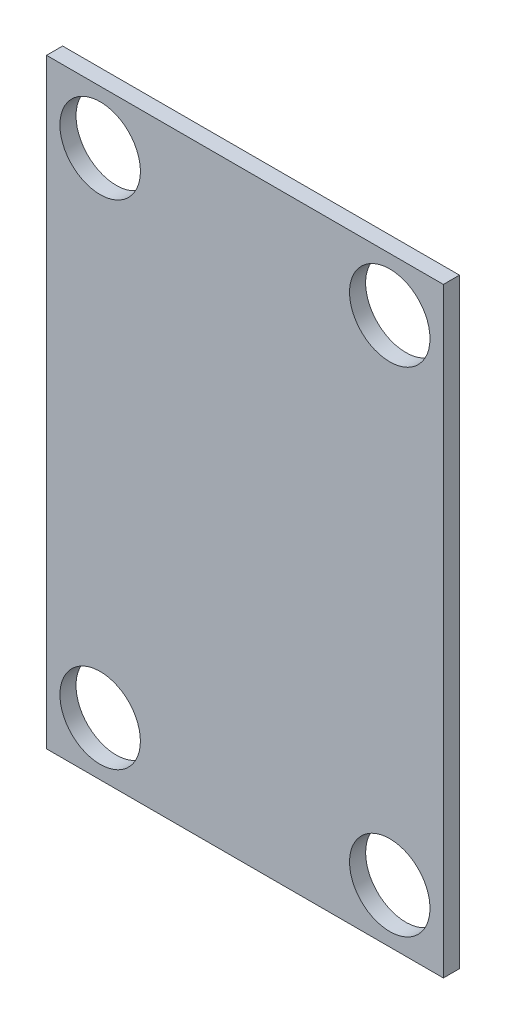
ISO-10303-21;
HEADER;
FILE_DESCRIPTION(('STEP AP214'),'2;1');
FILE_NAME('part.step','',(''),(''),'','','');
FILE_SCHEMA(('AUTOMOTIVE_DESIGN { 1 0 10303 214 1 1 1 1 }'));
ENDSEC;
DATA;
#1=APPLICATION_CONTEXT('core data for automotive mechanical design processes');
#2=APPLICATION_PROTOCOL_DEFINITION('international standard','automotive_design',2000,#1);
#3=PRODUCT_CONTEXT('',#1,'mechanical');
#4=PRODUCT('Part','Part','',(#3));
#5=PRODUCT_RELATED_PRODUCT_CATEGORY('part','',(#4));
#6=PRODUCT_DEFINITION_FORMATION('','',#4);
#7=PRODUCT_DEFINITION_CONTEXT('part definition',#1,'design');
#8=PRODUCT_DEFINITION('design','',#6,#7);
#9=PRODUCT_DEFINITION_SHAPE('','',#8);
#10=(LENGTH_UNIT() NAMED_UNIT(*) SI_UNIT(.MILLI.,.METRE.));
#11=(NAMED_UNIT(*) PLANE_ANGLE_UNIT() SI_UNIT($,.RADIAN.));
#12=(NAMED_UNIT(*) SI_UNIT($,.STERADIAN.) SOLID_ANGLE_UNIT());
#13=UNCERTAINTY_MEASURE_WITH_UNIT(LENGTH_MEASURE(1.E-05),#10,'distance_accuracy_value','');
#14=(GEOMETRIC_REPRESENTATION_CONTEXT(3) GLOBAL_UNCERTAINTY_ASSIGNED_CONTEXT((#13)) GLOBAL_UNIT_ASSIGNED_CONTEXT((#10,
#11,#12)) REPRESENTATION_CONTEXT('',''));
#15=CARTESIAN_POINT('',(0.,0.,0.));
#16=DIRECTION('',(0.,0.,1.));
#17=DIRECTION('',(1.,0.,0.));
#18=AXIS2_PLACEMENT_3D('',#15,#16,#17);
#19=CARTESIAN_POINT('',(0.,0.,1.5));
#20=DIRECTION('',(0.,0.,-1.));
#21=DIRECTION('',(-1.,0.,0.));
#22=AXIS2_PLACEMENT_3D('',#19,#20,#21);
#23=PLANE('',#22);
#24=DIRECTION('',(0.,1.,0.));
#25=VECTOR('',#24,1.);
#26=CARTESIAN_POINT('',(17.9594884742274,28.,1.5));
#27=LINE('',#26,#25);
#28=CARTESIAN_POINT('',(17.9594884742274,-28.,1.5));
#29=VERTEX_POINT('',#28);
#30=CARTESIAN_POINT('',(17.9594884742274,28.,1.5));
#31=VERTEX_POINT('',#30);
#32=EDGE_CURVE('E87',#29,#31,#27,.T.);
#33=ORIENTED_EDGE('',*,*,#32,.T.);
#34=DIRECTION('',(-1.,0.,0.));
#35=VECTOR('',#34,1.);
#36=CARTESIAN_POINT('',(17.9594884742274,28.,1.5));
#37=LINE('',#36,#35);
#38=CARTESIAN_POINT('',(-19.0405115257726,28.,1.5));
#39=VERTEX_POINT('',#38);
#40=EDGE_CURVE('E82',#31,#39,#37,.T.);
#41=ORIENTED_EDGE('',*,*,#40,.T.);
#42=DIRECTION('',(0.,-1.,0.));
#43=VECTOR('',#42,1.);
#44=CARTESIAN_POINT('',(-19.0405115257726,28.,1.5));
#45=LINE('',#44,#43);
#46=CARTESIAN_POINT('',(-19.0405115257726,-28.,1.5));
#47=VERTEX_POINT('',#46);
#48=EDGE_CURVE('E85',#39,#47,#45,.T.);
#49=ORIENTED_EDGE('',*,*,#48,.T.);
#50=DIRECTION('',(1.,0.,0.));
#51=VECTOR('',#50,1.);
#52=CARTESIAN_POINT('',(17.9594884742274,-28.,1.5));
#53=LINE('',#52,#51);
#54=EDGE_CURVE('E52',#47,#29,#53,.T.);
#55=ORIENTED_EDGE('',*,*,#54,.T.);
#56=EDGE_LOOP('',(#33,#41,#49,#55));
#57=FACE_BOUND('',#56,.T.);
#58=CARTESIAN_POINT('',(-14.0405115257726,23.,1.5));
#59=DIRECTION('',(0.,0.,1.));
#60=DIRECTION('',(-1.,0.,0.));
#61=AXIS2_PLACEMENT_3D('',#58,#59,#60);
#62=CIRCLE('',#61,3.75);
#63=CARTESIAN_POINT('',(-17.7905115257726,23.,1.5));
#64=VERTEX_POINT('',#63);
#65=EDGE_CURVE('E102',#64,#64,#62,.T.);
#66=ORIENTED_EDGE('',*,*,#65,.F.);
#67=EDGE_LOOP('',(#66));
#68=FACE_BOUND('',#67,.T.);
#69=CARTESIAN_POINT('',(-14.0405115257726,-23.,1.5));
#70=DIRECTION('',(0.,0.,1.));
#71=DIRECTION('',(1.,0.,0.));
#72=AXIS2_PLACEMENT_3D('',#69,#70,#71);
#73=CIRCLE('',#72,3.75);
#74=CARTESIAN_POINT('',(-10.2905115257726,-23.,1.5));
#75=VERTEX_POINT('',#74);
#76=EDGE_CURVE('E117',#75,#75,#73,.T.);
#77=ORIENTED_EDGE('',*,*,#76,.F.);
#78=EDGE_LOOP('',(#77));
#79=FACE_BOUND('',#78,.T.);
#80=CARTESIAN_POINT('',(12.9594884742275,23.,1.5));
#81=DIRECTION('',(0.,0.,1.));
#82=DIRECTION('',(1.,0.,0.));
#83=AXIS2_PLACEMENT_3D('',#80,#81,#82);
#84=CIRCLE('',#83,3.75);
#85=CARTESIAN_POINT('',(16.7094884742274,23.,1.5));
#86=VERTEX_POINT('',#85);
#87=EDGE_CURVE('E123',#86,#86,#84,.T.);
#88=ORIENTED_EDGE('',*,*,#87,.F.);
#89=EDGE_LOOP('',(#88));
#90=FACE_BOUND('',#89,.T.);
#91=CARTESIAN_POINT('',(12.9594884742275,-23.,1.5));
#92=DIRECTION('',(0.,0.,1.));
#93=DIRECTION('',(-1.,0.,0.));
#94=AXIS2_PLACEMENT_3D('',#91,#92,#93);
#95=CIRCLE('',#94,3.75);
#96=CARTESIAN_POINT('',(9.20948847422745,-23.,1.5));
#97=VERTEX_POINT('',#96);
#98=EDGE_CURVE('E129',#97,#97,#95,.T.);
#99=ORIENTED_EDGE('',*,*,#98,.F.);
#100=EDGE_LOOP('',(#99));
#101=FACE_BOUND('',#100,.T.);
#102=ADVANCED_FACE('F35',(#57,#68,#79,#90,#101),#23,.F.);
#103=CARTESIAN_POINT('',(0.,0.,0.));
#104=DIRECTION('',(0.,0.,-1.));
#105=DIRECTION('',(-1.,0.,0.));
#106=AXIS2_PLACEMENT_3D('',#103,#104,#105);
#107=PLANE('',#106);
#108=CARTESIAN_POINT('',(12.9594884742275,23.,0.));
#109=DIRECTION('',(0.,0.,1.));
#110=DIRECTION('',(1.,0.,0.));
#111=AXIS2_PLACEMENT_3D('',#108,#109,#110);
#112=CIRCLE('',#111,3.75);
#113=CARTESIAN_POINT('',(16.7094884742274,23.,0.));
#114=VERTEX_POINT('',#113);
#115=EDGE_CURVE('E126',#114,#114,#112,.T.);
#116=ORIENTED_EDGE('',*,*,#115,.T.);
#117=EDGE_LOOP('',(#116));
#118=FACE_BOUND('',#117,.T.);
#119=CARTESIAN_POINT('',(-14.0405115257726,23.,0.));
#120=DIRECTION('',(0.,0.,1.));
#121=DIRECTION('',(-1.,0.,0.));
#122=AXIS2_PLACEMENT_3D('',#119,#120,#121);
#123=CIRCLE('',#122,3.75);
#124=CARTESIAN_POINT('',(-17.7905115257726,23.,0.));
#125=VERTEX_POINT('',#124);
#126=EDGE_CURVE('E114',#125,#125,#123,.T.);
#127=ORIENTED_EDGE('',*,*,#126,.T.);
#128=EDGE_LOOP('',(#127));
#129=FACE_BOUND('',#128,.T.);
#130=DIRECTION('',(0.,1.,0.));
#131=VECTOR('',#130,1.);
#132=CARTESIAN_POINT('',(17.9594884742274,28.,0.));
#133=LINE('',#132,#131);
#134=CARTESIAN_POINT('',(17.9594884742274,-28.,0.));
#135=VERTEX_POINT('',#134);
#136=CARTESIAN_POINT('',(17.9594884742274,28.,0.));
#137=VERTEX_POINT('',#136);
#138=EDGE_CURVE('E99',#135,#137,#133,.T.);
#139=ORIENTED_EDGE('',*,*,#138,.F.);
#140=DIRECTION('',(1.,0.,0.));
#141=VECTOR('',#140,1.);
#142=CARTESIAN_POINT('',(17.9594884742274,-28.,0.));
#143=LINE('',#142,#141);
#144=CARTESIAN_POINT('',(-19.0405115257726,-28.,0.));
#145=VERTEX_POINT('',#144);
#146=EDGE_CURVE('E75',#145,#135,#143,.T.);
#147=ORIENTED_EDGE('',*,*,#146,.F.);
#148=DIRECTION('',(0.,-1.,0.));
#149=VECTOR('',#148,1.);
#150=CARTESIAN_POINT('',(-19.0405115257726,28.,0.));
#151=LINE('',#150,#149);
#152=CARTESIAN_POINT('',(-19.0405115257726,28.,0.));
#153=VERTEX_POINT('',#152);
#154=EDGE_CURVE('E69',#153,#145,#151,.T.);
#155=ORIENTED_EDGE('',*,*,#154,.F.);
#156=DIRECTION('',(-1.,0.,0.));
#157=VECTOR('',#156,1.);
#158=CARTESIAN_POINT('',(17.9594884742274,28.,0.));
#159=LINE('',#158,#157);
#160=EDGE_CURVE('E91',#137,#153,#159,.T.);
#161=ORIENTED_EDGE('',*,*,#160,.F.);
#162=EDGE_LOOP('',(#139,#147,#155,#161));
#163=FACE_BOUND('',#162,.T.);
#164=CARTESIAN_POINT('',(-14.0405115257726,-23.,0.));
#165=DIRECTION('',(0.,0.,1.));
#166=DIRECTION('',(1.,0.,0.));
#167=AXIS2_PLACEMENT_3D('',#164,#165,#166);
#168=CIRCLE('',#167,3.75);
#169=CARTESIAN_POINT('',(-10.2905115257726,-23.,0.));
#170=VERTEX_POINT('',#169);
#171=EDGE_CURVE('E120',#170,#170,#168,.T.);
#172=ORIENTED_EDGE('',*,*,#171,.T.);
#173=EDGE_LOOP('',(#172));
#174=FACE_BOUND('',#173,.T.);
#175=CARTESIAN_POINT('',(12.9594884742275,-23.,0.));
#176=DIRECTION('',(0.,0.,1.));
#177=DIRECTION('',(-1.,0.,0.));
#178=AXIS2_PLACEMENT_3D('',#175,#176,#177);
#179=CIRCLE('',#178,3.75);
#180=CARTESIAN_POINT('',(9.20948847422745,-23.,0.));
#181=VERTEX_POINT('',#180);
#182=EDGE_CURVE('E132',#181,#181,#179,.T.);
#183=ORIENTED_EDGE('',*,*,#182,.T.);
#184=EDGE_LOOP('',(#183));
#185=FACE_BOUND('',#184,.T.);
#186=ADVANCED_FACE('F110',(#118,#129,#163,#174,#185),#107,.T.);
#187=CARTESIAN_POINT('',(17.9594884742274,28.,1.5));
#188=DIRECTION('',(-1.,0.,0.));
#189=DIRECTION('',(0.,-1.,0.));
#190=AXIS2_PLACEMENT_3D('',#187,#188,#189);
#191=PLANE('',#190);
#192=ORIENTED_EDGE('',*,*,#138,.T.);
#193=DIRECTION('',(0.,0.,-1.));
#194=VECTOR('',#193,1.);
#195=CARTESIAN_POINT('',(17.9594884742274,28.,1.5));
#196=LINE('',#195,#194);
#197=EDGE_CURVE('E11',#31,#137,#196,.T.);
#198=ORIENTED_EDGE('',*,*,#197,.F.);
#199=ORIENTED_EDGE('',*,*,#32,.F.);
#200=DIRECTION('',(0.,0.,-1.));
#201=VECTOR('',#200,1.);
#202=CARTESIAN_POINT('',(17.9594884742274,-28.,1.5));
#203=LINE('',#202,#201);
#204=EDGE_CURVE('E95',#29,#135,#203,.T.);
#205=ORIENTED_EDGE('',*,*,#204,.T.);
#206=EDGE_LOOP('',(#192,#198,#199,#205));
#207=FACE_BOUND('',#206,.T.);
#208=ADVANCED_FACE('F37',(#207),#191,.F.);
#209=CARTESIAN_POINT('',(17.9594884742274,28.,1.5));
#210=DIRECTION('',(0.,-1.,0.));
#211=DIRECTION('',(1.,0.,0.));
#212=AXIS2_PLACEMENT_3D('',#209,#210,#211);
#213=PLANE('',#212);
#214=ORIENTED_EDGE('',*,*,#160,.T.);
#215=DIRECTION('',(0.,0.,-1.));
#216=VECTOR('',#215,1.);
#217=CARTESIAN_POINT('',(-19.0405115257726,28.,1.5));
#218=LINE('',#217,#216);
#219=EDGE_CURVE('E44',#39,#153,#218,.T.);
#220=ORIENTED_EDGE('',*,*,#219,.F.);
#221=ORIENTED_EDGE('',*,*,#40,.F.);
#222=ORIENTED_EDGE('',*,*,#197,.T.);
#223=EDGE_LOOP('',(#214,#220,#221,#222));
#224=FACE_BOUND('',#223,.T.);
#225=ADVANCED_FACE('F90',(#224),#213,.F.);
#226=CARTESIAN_POINT('',(-19.0405115257726,28.,1.5));
#227=DIRECTION('',(1.,0.,0.));
#228=DIRECTION('',(0.,0.,-1.));
#229=AXIS2_PLACEMENT_3D('',#226,#227,#228);
#230=PLANE('',#229);
#231=ORIENTED_EDGE('',*,*,#154,.T.);
#232=DIRECTION('',(0.,0.,-1.));
#233=VECTOR('',#232,1.);
#234=CARTESIAN_POINT('',(-19.0405115257726,-28.,1.5));
#235=LINE('',#234,#233);
#236=EDGE_CURVE('E92',#47,#145,#235,.T.);
#237=ORIENTED_EDGE('',*,*,#236,.F.);
#238=ORIENTED_EDGE('',*,*,#48,.F.);
#239=ORIENTED_EDGE('',*,*,#219,.T.);
#240=EDGE_LOOP('',(#231,#237,#238,#239));
#241=FACE_BOUND('',#240,.T.);
#242=ADVANCED_FACE('F93',(#241),#230,.F.);
#243=CARTESIAN_POINT('',(17.9594884742274,-28.,1.5));
#244=DIRECTION('',(0.,1.,0.));
#245=DIRECTION('',(-1.,0.,0.));
#246=AXIS2_PLACEMENT_3D('',#243,#244,#245);
#247=PLANE('',#246);
#248=ORIENTED_EDGE('',*,*,#146,.T.);
#249=ORIENTED_EDGE('',*,*,#204,.F.);
#250=ORIENTED_EDGE('',*,*,#54,.F.);
#251=ORIENTED_EDGE('',*,*,#236,.T.);
#252=EDGE_LOOP('',(#248,#249,#250,#251));
#253=FACE_BOUND('',#252,.T.);
#254=ADVANCED_FACE('F107',(#253),#247,.F.);
#255=CARTESIAN_POINT('',(-14.0405115257726,23.,1.5));
#256=DIRECTION('',(0.,0.,-1.));
#257=DIRECTION('',(-1.,0.,0.));
#258=AXIS2_PLACEMENT_3D('',#255,#256,#257);
#259=CYLINDRICAL_SURFACE('',#258,3.75);
#260=ORIENTED_EDGE('',*,*,#65,.T.);
#261=EDGE_LOOP('',(#260));
#262=FACE_BOUND('',#261,.T.);
#263=ORIENTED_EDGE('',*,*,#126,.F.);
#264=EDGE_LOOP('',(#263));
#265=FACE_BOUND('',#264,.T.);
#266=ADVANCED_FACE('F149',(#262,#265),#259,.F.);
#267=CARTESIAN_POINT('',(-14.0405115257726,-23.,1.5));
#268=DIRECTION('',(0.,0.,-1.));
#269=DIRECTION('',(-1.,0.,0.));
#270=AXIS2_PLACEMENT_3D('',#267,#268,#269);
#271=CYLINDRICAL_SURFACE('',#270,3.75);
#272=ORIENTED_EDGE('',*,*,#76,.T.);
#273=EDGE_LOOP('',(#272));
#274=FACE_BOUND('',#273,.T.);
#275=ORIENTED_EDGE('',*,*,#171,.F.);
#276=EDGE_LOOP('',(#275));
#277=FACE_BOUND('',#276,.T.);
#278=ADVANCED_FACE('F195',(#274,#277),#271,.F.);
#279=CARTESIAN_POINT('',(12.9594884742275,23.,1.5));
#280=DIRECTION('',(0.,0.,-1.));
#281=DIRECTION('',(-1.,0.,0.));
#282=AXIS2_PLACEMENT_3D('',#279,#280,#281);
#283=CYLINDRICAL_SURFACE('',#282,3.75);
#284=ORIENTED_EDGE('',*,*,#87,.T.);
#285=EDGE_LOOP('',(#284));
#286=FACE_BOUND('',#285,.T.);
#287=ORIENTED_EDGE('',*,*,#115,.F.);
#288=EDGE_LOOP('',(#287));
#289=FACE_BOUND('',#288,.T.);
#290=ADVANCED_FACE('F203',(#286,#289),#283,.F.);
#291=CARTESIAN_POINT('',(12.9594884742275,-23.,1.5));
#292=DIRECTION('',(0.,0.,-1.));
#293=DIRECTION('',(-1.,0.,0.));
#294=AXIS2_PLACEMENT_3D('',#291,#292,#293);
#295=CYLINDRICAL_SURFACE('',#294,3.75);
#296=ORIENTED_EDGE('',*,*,#98,.T.);
#297=EDGE_LOOP('',(#296));
#298=FACE_BOUND('',#297,.T.);
#299=ORIENTED_EDGE('',*,*,#182,.F.);
#300=EDGE_LOOP('',(#299));
#301=FACE_BOUND('',#300,.T.);
#302=ADVANCED_FACE('F138',(#298,#301),#295,.F.);
#303=CLOSED_SHELL('',(#102,#186,#208,#225,#242,#254,#266,#278,#290,#302));
#304=MANIFOLD_SOLID_BREP('B2',#303);
#305=ADVANCED_BREP_SHAPE_REPRESENTATION('',(#18,#304),#14);
#306=SHAPE_DEFINITION_REPRESENTATION(#9,#305);
ENDSEC;
END-ISO-10303-21;
